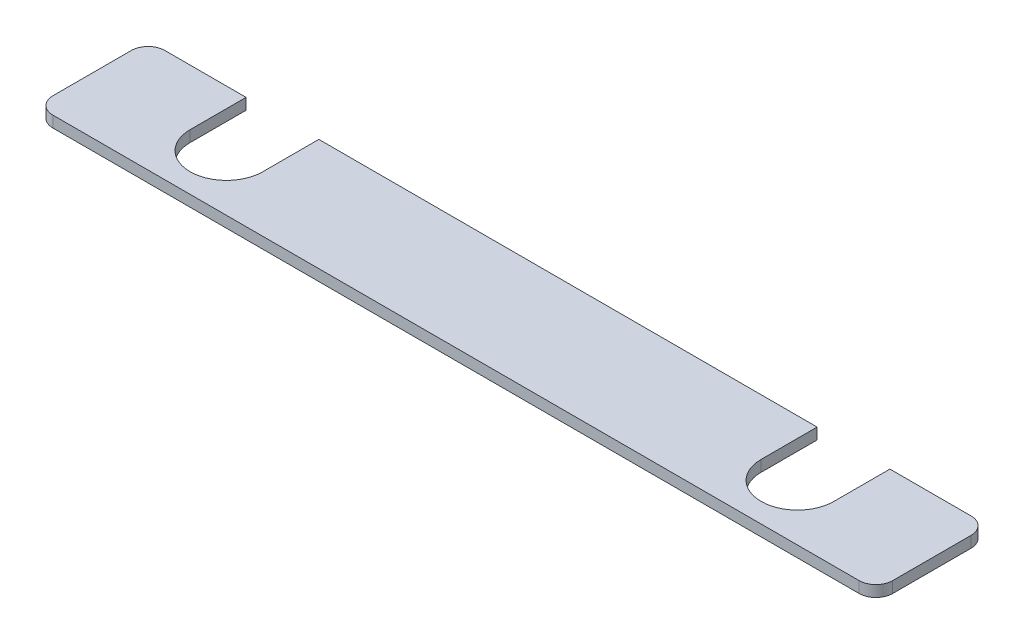
ISO-10303-21;
HEADER;
FILE_DESCRIPTION(('STEP AP214'),'2;1');
FILE_NAME('part.step','',(''),(''),'','','');
FILE_SCHEMA(('AUTOMOTIVE_DESIGN { 1 0 10303 214 1 1 1 1 }'));
ENDSEC;
DATA;
#1=APPLICATION_CONTEXT('core data for automotive mechanical design processes');
#2=APPLICATION_PROTOCOL_DEFINITION('international standard','automotive_design',2000,#1);
#3=PRODUCT_CONTEXT('',#1,'mechanical');
#4=PRODUCT('Part','Part','',(#3));
#5=PRODUCT_RELATED_PRODUCT_CATEGORY('part','',(#4));
#6=PRODUCT_DEFINITION_FORMATION('','',#4);
#7=PRODUCT_DEFINITION_CONTEXT('part definition',#1,'design');
#8=PRODUCT_DEFINITION('design','',#6,#7);
#9=PRODUCT_DEFINITION_SHAPE('','',#8);
#10=(LENGTH_UNIT() NAMED_UNIT(*) SI_UNIT(.MILLI.,.METRE.));
#11=(NAMED_UNIT(*) PLANE_ANGLE_UNIT() SI_UNIT($,.RADIAN.));
#12=(NAMED_UNIT(*) SI_UNIT($,.STERADIAN.) SOLID_ANGLE_UNIT());
#13=UNCERTAINTY_MEASURE_WITH_UNIT(LENGTH_MEASURE(1.E-05),#10,'distance_accuracy_value','');
#14=(GEOMETRIC_REPRESENTATION_CONTEXT(3) GLOBAL_UNCERTAINTY_ASSIGNED_CONTEXT((#13)) GLOBAL_UNIT_ASSIGNED_CONTEXT((#10,
#11,#12)) REPRESENTATION_CONTEXT('',''));
#15=CARTESIAN_POINT('',(0.,0.,0.));
#16=DIRECTION('',(0.,0.,1.));
#17=DIRECTION('',(1.,0.,0.));
#18=AXIS2_PLACEMENT_3D('',#15,#16,#17);
#19=CARTESIAN_POINT('',(-75.,-2.,-10.));
#20=DIRECTION('',(0.,0.,-1.));
#21=DIRECTION('',(-1.,0.,0.));
#22=AXIS2_PLACEMENT_3D('',#19,#20,#21);
#23=PLANE('',#22);
#24=DIRECTION('',(-1.,0.,0.));
#25=VECTOR('',#24,1.);
#26=CARTESIAN_POINT('',(-75.,0.,-10.));
#27=LINE('',#26,#25);
#28=CARTESIAN_POINT('',(72.,0.,-10.));
#29=VERTEX_POINT('',#28);
#30=CARTESIAN_POINT('',(57.5,0.,-10.));
#31=VERTEX_POINT('',#30);
#32=EDGE_CURVE('E228',#29,#31,#27,.T.);
#33=ORIENTED_EDGE('',*,*,#32,.F.);
#34=DIRECTION('',(0.,1.,0.));
#35=VECTOR('',#34,1.);
#36=CARTESIAN_POINT('',(72.,-2.,-10.));
#37=LINE('',#36,#35);
#38=CARTESIAN_POINT('',(72.,-2.,-10.));
#39=VERTEX_POINT('',#38);
#40=EDGE_CURVE('E265',#29,#39,#37,.F.);
#41=ORIENTED_EDGE('',*,*,#40,.T.);
#42=DIRECTION('',(-1.,0.,0.));
#43=VECTOR('',#42,1.);
#44=CARTESIAN_POINT('',(-75.,-2.,-10.));
#45=LINE('',#44,#43);
#46=CARTESIAN_POINT('',(57.5,-2.,-10.));
#47=VERTEX_POINT('',#46);
#48=EDGE_CURVE('E217',#39,#47,#45,.T.);
#49=ORIENTED_EDGE('',*,*,#48,.T.);
#50=DIRECTION('',(0.,1.,0.));
#51=VECTOR('',#50,1.);
#52=CARTESIAN_POINT('',(57.5,-2.,-10.));
#53=LINE('',#52,#51);
#54=EDGE_CURVE('E184',#47,#31,#53,.T.);
#55=ORIENTED_EDGE('',*,*,#54,.T.);
#56=EDGE_LOOP('',(#33,#41,#49,#55));
#57=FACE_BOUND('',#56,.T.);
#58=ADVANCED_FACE('F36',(#57),#23,.T.);
#59=CARTESIAN_POINT('',(44.5,0.,-10.));
#60=VERTEX_POINT('',#59);
#61=CARTESIAN_POINT('',(-44.5,0.,-10.));
#62=VERTEX_POINT('',#61);
#63=EDGE_CURVE('E231',#60,#62,#27,.T.);
#64=ORIENTED_EDGE('',*,*,#63,.F.);
#65=DIRECTION('',(0.,-1.,0.));
#66=VECTOR('',#65,1.);
#67=CARTESIAN_POINT('',(44.5,-2.,-10.));
#68=LINE('',#67,#66);
#69=CARTESIAN_POINT('',(44.5,-2.,-10.));
#70=VERTEX_POINT('',#69);
#71=EDGE_CURVE('E181',#60,#70,#68,.T.);
#72=ORIENTED_EDGE('',*,*,#71,.T.);
#73=CARTESIAN_POINT('',(-44.5,-2.,-10.));
#74=VERTEX_POINT('',#73);
#75=EDGE_CURVE('E174',#70,#74,#45,.T.);
#76=ORIENTED_EDGE('',*,*,#75,.T.);
#77=DIRECTION('',(0.,-1.,0.));
#78=VECTOR('',#77,1.);
#79=CARTESIAN_POINT('',(-44.5,-2.,-10.));
#80=LINE('',#79,#78);
#81=EDGE_CURVE('E208',#62,#74,#80,.T.);
#82=ORIENTED_EDGE('',*,*,#81,.F.);
#83=EDGE_LOOP('',(#64,#72,#76,#82));
#84=FACE_BOUND('',#83,.T.);
#85=ADVANCED_FACE('F288',(#84),#23,.T.);
#86=CARTESIAN_POINT('',(0.,-2.,0.));
#87=DIRECTION('',(0.,-1.,0.));
#88=DIRECTION('',(0.,0.,-1.));
#89=AXIS2_PLACEMENT_3D('',#86,#87,#88);
#90=PLANE('',#89);
#91=DIRECTION('',(0.,0.,-1.));
#92=VECTOR('',#91,1.);
#93=CARTESIAN_POINT('',(75.,-2.,10.));
#94=LINE('',#93,#92);
#95=CARTESIAN_POINT('',(75.,-2.,7.));
#96=VERTEX_POINT('',#95);
#97=CARTESIAN_POINT('',(75.,-2.,-7.));
#98=VERTEX_POINT('',#97);
#99=EDGE_CURVE('E212',#96,#98,#94,.T.);
#100=ORIENTED_EDGE('',*,*,#99,.F.);
#101=CARTESIAN_POINT('',(72.,-2.,7.));
#102=DIRECTION('',(0.,-1.,0.));
#103=DIRECTION('',(0.,0.,-1.));
#104=AXIS2_PLACEMENT_3D('',#101,#102,#103);
#105=CIRCLE('',#104,3.);
#106=CARTESIAN_POINT('',(72.,-2.,10.));
#107=VERTEX_POINT('',#106);
#108=EDGE_CURVE('E263',#96,#107,#105,.T.);
#109=ORIENTED_EDGE('',*,*,#108,.T.);
#110=DIRECTION('',(1.,0.,0.));
#111=VECTOR('',#110,1.);
#112=CARTESIAN_POINT('',(-75.,-2.,10.));
#113=LINE('',#112,#111);
#114=CARTESIAN_POINT('',(-72.,-2.,10.));
#115=VERTEX_POINT('',#114);
#116=EDGE_CURVE('E221',#115,#107,#113,.T.);
#117=ORIENTED_EDGE('',*,*,#116,.F.);
#118=CARTESIAN_POINT('',(-72.,-2.,7.));
#119=DIRECTION('',(0.,-1.,0.));
#120=DIRECTION('',(0.,0.,-1.));
#121=AXIS2_PLACEMENT_3D('',#118,#119,#120);
#122=CIRCLE('',#121,3.);
#123=CARTESIAN_POINT('',(-75.,-2.,7.));
#124=VERTEX_POINT('',#123);
#125=EDGE_CURVE('E57',#115,#124,#122,.T.);
#126=ORIENTED_EDGE('',*,*,#125,.T.);
#127=DIRECTION('',(0.,0.,1.));
#128=VECTOR('',#127,1.);
#129=CARTESIAN_POINT('',(-75.,-2.,10.));
#130=LINE('',#129,#128);
#131=CARTESIAN_POINT('',(-75.,-2.,-7.));
#132=VERTEX_POINT('',#131);
#133=EDGE_CURVE('E219',#132,#124,#130,.T.);
#134=ORIENTED_EDGE('',*,*,#133,.F.);
#135=CARTESIAN_POINT('',(-72.,-2.,-7.));
#136=DIRECTION('',(0.,-1.,0.));
#137=DIRECTION('',(0.,0.,-1.));
#138=AXIS2_PLACEMENT_3D('',#135,#136,#137);
#139=CIRCLE('',#138,3.);
#140=CARTESIAN_POINT('',(-72.,-2.,-10.));
#141=VERTEX_POINT('',#140);
#142=EDGE_CURVE('E51',#132,#141,#139,.T.);
#143=ORIENTED_EDGE('',*,*,#142,.T.);
#144=CARTESIAN_POINT('',(-57.5,-2.,-10.));
#145=VERTEX_POINT('',#144);
#146=EDGE_CURVE('E215',#145,#141,#45,.T.);
#147=ORIENTED_EDGE('',*,*,#146,.F.);
#148=DIRECTION('',(0.,0.,1.));
#149=VECTOR('',#148,1.);
#150=CARTESIAN_POINT('',(-57.5,-2.,-20.));
#151=LINE('',#150,#149);
#152=CARTESIAN_POINT('',(-57.5,-2.,0.));
#153=VERTEX_POINT('',#152);
#154=EDGE_CURVE('E188',#145,#153,#151,.T.);
#155=ORIENTED_EDGE('',*,*,#154,.T.);
#156=CARTESIAN_POINT('',(-51.,-2.,0.));
#157=DIRECTION('',(0.,1.,0.));
#158=DIRECTION('',(0.,0.,1.));
#159=AXIS2_PLACEMENT_3D('',#156,#157,#158);
#160=CIRCLE('',#159,6.5);
#161=CARTESIAN_POINT('',(-44.5,-2.,0.));
#162=VERTEX_POINT('',#161);
#163=EDGE_CURVE('E191',#153,#162,#160,.T.);
#164=ORIENTED_EDGE('',*,*,#163,.T.);
#165=DIRECTION('',(0.,0.,-1.));
#166=VECTOR('',#165,1.);
#167=CARTESIAN_POINT('',(-44.5,-2.,-20.));
#168=LINE('',#167,#166);
#169=EDGE_CURVE('E195',#162,#74,#168,.T.);
#170=ORIENTED_EDGE('',*,*,#169,.T.);
#171=ORIENTED_EDGE('',*,*,#75,.F.);
#172=DIRECTION('',(0.,0.,-1.));
#173=VECTOR('',#172,1.);
#174=CARTESIAN_POINT('',(44.5,-2.,-20.));
#175=LINE('',#174,#173);
#176=CARTESIAN_POINT('',(44.5,-2.,0.));
#177=VERTEX_POINT('',#176);
#178=EDGE_CURVE('E161',#177,#70,#175,.T.);
#179=ORIENTED_EDGE('',*,*,#178,.F.);
#180=CARTESIAN_POINT('',(51.,-2.,0.));
#181=DIRECTION('',(0.,-1.,0.));
#182=DIRECTION('',(0.,0.,1.));
#183=AXIS2_PLACEMENT_3D('',#180,#181,#182);
#184=CIRCLE('',#183,6.5);
#185=CARTESIAN_POINT('',(57.5,-2.,0.));
#186=VERTEX_POINT('',#185);
#187=EDGE_CURVE('E151',#186,#177,#184,.T.);
#188=ORIENTED_EDGE('',*,*,#187,.F.);
#189=DIRECTION('',(0.,0.,1.));
#190=VECTOR('',#189,1.);
#191=CARTESIAN_POINT('',(57.5,-2.,-20.));
#192=LINE('',#191,#190);
#193=EDGE_CURVE('E160',#47,#186,#192,.T.);
#194=ORIENTED_EDGE('',*,*,#193,.F.);
#195=ORIENTED_EDGE('',*,*,#48,.F.);
#196=CARTESIAN_POINT('',(72.,-2.,-7.));
#197=DIRECTION('',(0.,-1.,0.));
#198=DIRECTION('',(0.,0.,-1.));
#199=AXIS2_PLACEMENT_3D('',#196,#197,#198);
#200=CIRCLE('',#199,3.);
#201=EDGE_CURVE('E261',#39,#98,#200,.T.);
#202=ORIENTED_EDGE('',*,*,#201,.T.);
#203=EDGE_LOOP('',(#100,#109,#117,#126,#134,#143,#147,#155,#164,#170,#171,#179,#188,#194,#195,#202));
#204=FACE_BOUND('',#203,.T.);
#205=ADVANCED_FACE('F172',(#204),#90,.T.);
#206=CARTESIAN_POINT('',(0.,0.,0.));
#207=DIRECTION('',(0.,-1.,0.));
#208=DIRECTION('',(0.,0.,-1.));
#209=AXIS2_PLACEMENT_3D('',#206,#207,#208);
#210=PLANE('',#209);
#211=DIRECTION('',(1.,0.,0.));
#212=VECTOR('',#211,1.);
#213=CARTESIAN_POINT('',(-75.,0.,10.));
#214=LINE('',#213,#212);
#215=CARTESIAN_POINT('',(-72.,0.,10.));
#216=VERTEX_POINT('',#215);
#217=CARTESIAN_POINT('',(72.,0.,10.));
#218=VERTEX_POINT('',#217);
#219=EDGE_CURVE('E216',#216,#218,#214,.T.);
#220=ORIENTED_EDGE('',*,*,#219,.T.);
#221=CARTESIAN_POINT('',(72.,0.,7.));
#222=DIRECTION('',(0.,-1.,0.));
#223=DIRECTION('',(0.,0.,-1.));
#224=AXIS2_PLACEMENT_3D('',#221,#222,#223);
#225=CIRCLE('',#224,3.);
#226=CARTESIAN_POINT('',(75.,0.,7.));
#227=VERTEX_POINT('',#226);
#228=EDGE_CURVE('E252',#218,#227,#225,.F.);
#229=ORIENTED_EDGE('',*,*,#228,.T.);
#230=DIRECTION('',(0.,0.,-1.));
#231=VECTOR('',#230,1.);
#232=CARTESIAN_POINT('',(75.,0.,10.));
#233=LINE('',#232,#231);
#234=CARTESIAN_POINT('',(75.,0.,-7.));
#235=VERTEX_POINT('',#234);
#236=EDGE_CURVE('E211',#227,#235,#233,.T.);
#237=ORIENTED_EDGE('',*,*,#236,.T.);
#238=CARTESIAN_POINT('',(72.,0.,-7.));
#239=DIRECTION('',(0.,-1.,0.));
#240=DIRECTION('',(0.,0.,-1.));
#241=AXIS2_PLACEMENT_3D('',#238,#239,#240);
#242=CIRCLE('',#241,3.);
#243=EDGE_CURVE('E250',#235,#29,#242,.F.);
#244=ORIENTED_EDGE('',*,*,#243,.T.);
#245=ORIENTED_EDGE('',*,*,#32,.T.);
#246=DIRECTION('',(0.,0.,-1.));
#247=VECTOR('',#246,1.);
#248=CARTESIAN_POINT('',(57.5,0.,0.));
#249=LINE('',#248,#247);
#250=CARTESIAN_POINT('',(57.5,0.,0.));
#251=VERTEX_POINT('',#250);
#252=EDGE_CURVE('E238',#251,#31,#249,.T.);
#253=ORIENTED_EDGE('',*,*,#252,.F.);
#254=CARTESIAN_POINT('',(51.,0.,0.));
#255=DIRECTION('',(0.,-1.,0.));
#256=DIRECTION('',(0.,0.,1.));
#257=AXIS2_PLACEMENT_3D('',#254,#255,#256);
#258=CIRCLE('',#257,6.5);
#259=CARTESIAN_POINT('',(44.5,0.,0.));
#260=VERTEX_POINT('',#259);
#261=EDGE_CURVE('E175',#251,#260,#258,.T.);
#262=ORIENTED_EDGE('',*,*,#261,.T.);
#263=DIRECTION('',(0.,0.,-1.));
#264=VECTOR('',#263,1.);
#265=CARTESIAN_POINT('',(44.5,0.,-20.));
#266=LINE('',#265,#264);
#267=EDGE_CURVE('E167',#260,#60,#266,.T.);
#268=ORIENTED_EDGE('',*,*,#267,.T.);
#269=ORIENTED_EDGE('',*,*,#63,.T.);
#270=DIRECTION('',(0.,0.,-1.));
#271=VECTOR('',#270,1.);
#272=CARTESIAN_POINT('',(-44.5,0.,-20.));
#273=LINE('',#272,#271);
#274=CARTESIAN_POINT('',(-44.5,0.,0.));
#275=VERTEX_POINT('',#274);
#276=EDGE_CURVE('E192',#275,#62,#273,.T.);
#277=ORIENTED_EDGE('',*,*,#276,.F.);
#278=CARTESIAN_POINT('',(-51.,0.,0.));
#279=DIRECTION('',(0.,1.,0.));
#280=DIRECTION('',(0.,0.,1.));
#281=AXIS2_PLACEMENT_3D('',#278,#279,#280);
#282=CIRCLE('',#281,6.5);
#283=CARTESIAN_POINT('',(-57.5,0.,0.));
#284=VERTEX_POINT('',#283);
#285=EDGE_CURVE('E187',#284,#275,#282,.T.);
#286=ORIENTED_EDGE('',*,*,#285,.F.);
#287=DIRECTION('',(0.,0.,-1.));
#288=VECTOR('',#287,1.);
#289=CARTESIAN_POINT('',(-57.5,0.,0.));
#290=LINE('',#289,#288);
#291=CARTESIAN_POINT('',(-57.5,0.,-10.));
#292=VERTEX_POINT('',#291);
#293=EDGE_CURVE('E224',#284,#292,#290,.T.);
#294=ORIENTED_EDGE('',*,*,#293,.T.);
#295=CARTESIAN_POINT('',(-72.,0.,-10.));
#296=VERTEX_POINT('',#295);
#297=EDGE_CURVE('E227',#292,#296,#27,.T.);
#298=ORIENTED_EDGE('',*,*,#297,.T.);
#299=CARTESIAN_POINT('',(-72.,0.,-7.));
#300=DIRECTION('',(0.,-1.,0.));
#301=DIRECTION('',(0.,0.,-1.));
#302=AXIS2_PLACEMENT_3D('',#299,#300,#301);
#303=CIRCLE('',#302,3.);
#304=CARTESIAN_POINT('',(-75.,0.,-7.));
#305=VERTEX_POINT('',#304);
#306=EDGE_CURVE('E246',#296,#305,#303,.F.);
#307=ORIENTED_EDGE('',*,*,#306,.T.);
#308=DIRECTION('',(0.,0.,1.));
#309=VECTOR('',#308,1.);
#310=CARTESIAN_POINT('',(-75.,0.,10.));
#311=LINE('',#310,#309);
#312=CARTESIAN_POINT('',(-75.,0.,7.));
#313=VERTEX_POINT('',#312);
#314=EDGE_CURVE('E230',#305,#313,#311,.T.);
#315=ORIENTED_EDGE('',*,*,#314,.T.);
#316=CARTESIAN_POINT('',(-72.,0.,7.));
#317=DIRECTION('',(0.,-1.,0.));
#318=DIRECTION('',(0.,0.,-1.));
#319=AXIS2_PLACEMENT_3D('',#316,#317,#318);
#320=CIRCLE('',#319,3.);
#321=EDGE_CURVE('E248',#313,#216,#320,.F.);
#322=ORIENTED_EDGE('',*,*,#321,.T.);
#323=EDGE_LOOP('',(#220,#229,#237,#244,#245,#253,#262,#268,#269,#277,#286,#294,#298,#307,#315,#322));
#324=FACE_BOUND('',#323,.T.);
#325=ADVANCED_FACE('F276',(#324),#210,.F.);
#326=CARTESIAN_POINT('',(75.,-2.,10.));
#327=DIRECTION('',(1.,0.,0.));
#328=DIRECTION('',(0.,0.,-1.));
#329=AXIS2_PLACEMENT_3D('',#326,#327,#328);
#330=PLANE('',#329);
#331=ORIENTED_EDGE('',*,*,#236,.F.);
#332=DIRECTION('',(0.,1.,0.));
#333=VECTOR('',#332,1.);
#334=CARTESIAN_POINT('',(75.,-2.,7.));
#335=LINE('',#334,#333);
#336=EDGE_CURVE('E257',#227,#96,#335,.F.);
#337=ORIENTED_EDGE('',*,*,#336,.T.);
#338=ORIENTED_EDGE('',*,*,#99,.T.);
#339=DIRECTION('',(0.,1.,0.));
#340=VECTOR('',#339,1.);
#341=CARTESIAN_POINT('',(75.,-2.,-7.));
#342=LINE('',#341,#340);
#343=EDGE_CURVE('E254',#98,#235,#342,.T.);
#344=ORIENTED_EDGE('',*,*,#343,.T.);
#345=EDGE_LOOP('',(#331,#337,#338,#344));
#346=FACE_BOUND('',#345,.T.);
#347=ADVANCED_FACE('F311',(#346),#330,.T.);
#348=CARTESIAN_POINT('',(-75.,-2.,10.));
#349=DIRECTION('',(0.,0.,1.));
#350=DIRECTION('',(1.,0.,0.));
#351=AXIS2_PLACEMENT_3D('',#348,#349,#350);
#352=PLANE('',#351);
#353=ORIENTED_EDGE('',*,*,#116,.T.);
#354=DIRECTION('',(0.,1.,0.));
#355=VECTOR('',#354,1.);
#356=CARTESIAN_POINT('',(72.,-2.,10.));
#357=LINE('',#356,#355);
#358=EDGE_CURVE('E243',#107,#218,#357,.T.);
#359=ORIENTED_EDGE('',*,*,#358,.T.);
#360=ORIENTED_EDGE('',*,*,#219,.F.);
#361=DIRECTION('',(0.,1.,0.));
#362=VECTOR('',#361,1.);
#363=CARTESIAN_POINT('',(-72.,-2.,10.));
#364=LINE('',#363,#362);
#365=EDGE_CURVE('E241',#216,#115,#364,.F.);
#366=ORIENTED_EDGE('',*,*,#365,.T.);
#367=EDGE_LOOP('',(#353,#359,#360,#366));
#368=FACE_BOUND('',#367,.T.);
#369=ADVANCED_FACE('F318',(#368),#352,.T.);
#370=CARTESIAN_POINT('',(-75.,-2.,10.));
#371=DIRECTION('',(-1.,0.,0.));
#372=DIRECTION('',(0.,0.,1.));
#373=AXIS2_PLACEMENT_3D('',#370,#371,#372);
#374=PLANE('',#373);
#375=ORIENTED_EDGE('',*,*,#133,.T.);
#376=DIRECTION('',(0.,1.,0.));
#377=VECTOR('',#376,1.);
#378=CARTESIAN_POINT('',(-75.,-2.,7.));
#379=LINE('',#378,#377);
#380=EDGE_CURVE('E44',#124,#313,#379,.T.);
#381=ORIENTED_EDGE('',*,*,#380,.T.);
#382=ORIENTED_EDGE('',*,*,#314,.F.);
#383=DIRECTION('',(0.,1.,0.));
#384=VECTOR('',#383,1.);
#385=CARTESIAN_POINT('',(-75.,-2.,-7.));
#386=LINE('',#385,#384);
#387=EDGE_CURVE('E267',#305,#132,#386,.F.);
#388=ORIENTED_EDGE('',*,*,#387,.T.);
#389=EDGE_LOOP('',(#375,#381,#382,#388));
#390=FACE_BOUND('',#389,.T.);
#391=ADVANCED_FACE('F272',(#390),#374,.T.);
#392=ORIENTED_EDGE('',*,*,#146,.T.);
#393=DIRECTION('',(0.,1.,0.));
#394=VECTOR('',#393,1.);
#395=CARTESIAN_POINT('',(-72.,-2.,-10.));
#396=LINE('',#395,#394);
#397=EDGE_CURVE('E11',#141,#296,#396,.T.);
#398=ORIENTED_EDGE('',*,*,#397,.T.);
#399=ORIENTED_EDGE('',*,*,#297,.F.);
#400=DIRECTION('',(0.,1.,0.));
#401=VECTOR('',#400,1.);
#402=CARTESIAN_POINT('',(-57.5,-2.,-10.));
#403=LINE('',#402,#401);
#404=EDGE_CURVE('E204',#145,#292,#403,.T.);
#405=ORIENTED_EDGE('',*,*,#404,.F.);
#406=EDGE_LOOP('',(#392,#398,#399,#405));
#407=FACE_BOUND('',#406,.T.);
#408=ADVANCED_FACE('F283',(#407),#23,.T.);
#409=CARTESIAN_POINT('',(-44.5,-2.,-20.));
#410=DIRECTION('',(1.,0.,0.));
#411=DIRECTION('',(0.,0.,-1.));
#412=AXIS2_PLACEMENT_3D('',#409,#410,#411);
#413=PLANE('',#412);
#414=ORIENTED_EDGE('',*,*,#81,.T.);
#415=ORIENTED_EDGE('',*,*,#169,.F.);
#416=DIRECTION('',(0.,1.,0.));
#417=VECTOR('',#416,1.);
#418=CARTESIAN_POINT('',(-44.5,-2.,0.));
#419=LINE('',#418,#417);
#420=EDGE_CURVE('E202',#162,#275,#419,.T.);
#421=ORIENTED_EDGE('',*,*,#420,.T.);
#422=ORIENTED_EDGE('',*,*,#276,.T.);
#423=EDGE_LOOP('',(#414,#415,#421,#422));
#424=FACE_BOUND('',#423,.T.);
#425=ADVANCED_FACE('F291',(#424),#413,.F.);
#426=CARTESIAN_POINT('',(-51.,-2.,0.));
#427=DIRECTION('',(0.,1.,0.));
#428=DIRECTION('',(0.,0.,1.));
#429=AXIS2_PLACEMENT_3D('',#426,#427,#428);
#430=CYLINDRICAL_SURFACE('',#429,6.5);
#431=ORIENTED_EDGE('',*,*,#285,.T.);
#432=ORIENTED_EDGE('',*,*,#420,.F.);
#433=ORIENTED_EDGE('',*,*,#163,.F.);
#434=DIRECTION('',(0.,1.,0.));
#435=VECTOR('',#434,1.);
#436=CARTESIAN_POINT('',(-57.5,-2.,0.));
#437=LINE('',#436,#435);
#438=EDGE_CURVE('E197',#153,#284,#437,.T.);
#439=ORIENTED_EDGE('',*,*,#438,.T.);
#440=EDGE_LOOP('',(#431,#432,#433,#439));
#441=FACE_BOUND('',#440,.T.);
#442=ADVANCED_FACE('F295',(#441),#430,.F.);
#443=CARTESIAN_POINT('',(-57.5,-2.,-20.));
#444=DIRECTION('',(-1.,0.,0.));
#445=DIRECTION('',(0.,0.,1.));
#446=AXIS2_PLACEMENT_3D('',#443,#444,#445);
#447=PLANE('',#446);
#448=ORIENTED_EDGE('',*,*,#404,.T.);
#449=ORIENTED_EDGE('',*,*,#293,.F.);
#450=ORIENTED_EDGE('',*,*,#438,.F.);
#451=ORIENTED_EDGE('',*,*,#154,.F.);
#452=EDGE_LOOP('',(#448,#449,#450,#451));
#453=FACE_BOUND('',#452,.T.);
#454=ADVANCED_FACE('F349',(#453),#447,.F.);
#455=CARTESIAN_POINT('',(57.5,-2.,-20.));
#456=DIRECTION('',(-1.,0.,0.));
#457=DIRECTION('',(0.,0.,1.));
#458=AXIS2_PLACEMENT_3D('',#455,#456,#457);
#459=PLANE('',#458);
#460=ORIENTED_EDGE('',*,*,#193,.T.);
#461=DIRECTION('',(0.,1.,0.));
#462=VECTOR('',#461,1.);
#463=CARTESIAN_POINT('',(57.5,-2.,0.));
#464=LINE('',#463,#462);
#465=EDGE_CURVE('E157',#186,#251,#464,.T.);
#466=ORIENTED_EDGE('',*,*,#465,.T.);
#467=ORIENTED_EDGE('',*,*,#252,.T.);
#468=ORIENTED_EDGE('',*,*,#54,.F.);
#469=EDGE_LOOP('',(#460,#466,#467,#468));
#470=FACE_BOUND('',#469,.T.);
#471=ADVANCED_FACE('F301',(#470),#459,.T.);
#472=CARTESIAN_POINT('',(51.,-2.,0.));
#473=DIRECTION('',(0.,1.,0.));
#474=DIRECTION('',(0.,0.,1.));
#475=AXIS2_PLACEMENT_3D('',#472,#473,#474);
#476=CYLINDRICAL_SURFACE('',#475,6.5);
#477=ORIENTED_EDGE('',*,*,#261,.F.);
#478=ORIENTED_EDGE('',*,*,#465,.F.);
#479=ORIENTED_EDGE('',*,*,#187,.T.);
#480=DIRECTION('',(0.,1.,0.));
#481=VECTOR('',#480,1.);
#482=CARTESIAN_POINT('',(44.5,-2.,0.));
#483=LINE('',#482,#481);
#484=EDGE_CURVE('E155',#177,#260,#483,.T.);
#485=ORIENTED_EDGE('',*,*,#484,.T.);
#486=EDGE_LOOP('',(#477,#478,#479,#485));
#487=FACE_BOUND('',#486,.T.);
#488=ADVANCED_FACE('F154',(#487),#476,.F.);
#489=CARTESIAN_POINT('',(44.5,-2.,-20.));
#490=DIRECTION('',(1.,0.,0.));
#491=DIRECTION('',(0.,0.,-1.));
#492=AXIS2_PLACEMENT_3D('',#489,#490,#491);
#493=PLANE('',#492);
#494=ORIENTED_EDGE('',*,*,#267,.F.);
#495=ORIENTED_EDGE('',*,*,#484,.F.);
#496=ORIENTED_EDGE('',*,*,#178,.T.);
#497=ORIENTED_EDGE('',*,*,#71,.F.);
#498=EDGE_LOOP('',(#494,#495,#496,#497));
#499=FACE_BOUND('',#498,.T.);
#500=ADVANCED_FACE('F164',(#499),#493,.T.);
#501=CARTESIAN_POINT('',(72.,-2.,7.));
#502=DIRECTION('',(0.,1.,0.));
#503=DIRECTION('',(0.,0.,1.));
#504=AXIS2_PLACEMENT_3D('',#501,#502,#503);
#505=CYLINDRICAL_SURFACE('',#504,3.);
#506=ORIENTED_EDGE('',*,*,#108,.F.);
#507=ORIENTED_EDGE('',*,*,#336,.F.);
#508=ORIENTED_EDGE('',*,*,#228,.F.);
#509=ORIENTED_EDGE('',*,*,#358,.F.);
#510=EDGE_LOOP('',(#506,#507,#508,#509));
#511=FACE_BOUND('',#510,.T.);
#512=ADVANCED_FACE('F316',(#511),#505,.T.);
#513=CARTESIAN_POINT('',(72.,-2.,-7.));
#514=DIRECTION('',(0.,1.,0.));
#515=DIRECTION('',(0.,0.,1.));
#516=AXIS2_PLACEMENT_3D('',#513,#514,#515);
#517=CYLINDRICAL_SURFACE('',#516,3.);
#518=ORIENTED_EDGE('',*,*,#201,.F.);
#519=ORIENTED_EDGE('',*,*,#40,.F.);
#520=ORIENTED_EDGE('',*,*,#243,.F.);
#521=ORIENTED_EDGE('',*,*,#343,.F.);
#522=EDGE_LOOP('',(#518,#519,#520,#521));
#523=FACE_BOUND('',#522,.T.);
#524=ADVANCED_FACE('F308',(#523),#517,.T.);
#525=CARTESIAN_POINT('',(-72.,-2.,7.));
#526=DIRECTION('',(0.,1.,0.));
#527=DIRECTION('',(0.,0.,1.));
#528=AXIS2_PLACEMENT_3D('',#525,#526,#527);
#529=CYLINDRICAL_SURFACE('',#528,3.);
#530=ORIENTED_EDGE('',*,*,#125,.F.);
#531=ORIENTED_EDGE('',*,*,#365,.F.);
#532=ORIENTED_EDGE('',*,*,#321,.F.);
#533=ORIENTED_EDGE('',*,*,#380,.F.);
#534=EDGE_LOOP('',(#530,#531,#532,#533));
#535=FACE_BOUND('',#534,.T.);
#536=ADVANCED_FACE('F320',(#535),#529,.T.);
#537=CARTESIAN_POINT('',(-72.,-2.,-7.));
#538=DIRECTION('',(0.,1.,0.));
#539=DIRECTION('',(0.,0.,1.));
#540=AXIS2_PLACEMENT_3D('',#537,#538,#539);
#541=CYLINDRICAL_SURFACE('',#540,3.);
#542=ORIENTED_EDGE('',*,*,#142,.F.);
#543=ORIENTED_EDGE('',*,*,#387,.F.);
#544=ORIENTED_EDGE('',*,*,#306,.F.);
#545=ORIENTED_EDGE('',*,*,#397,.F.);
#546=EDGE_LOOP('',(#542,#543,#544,#545));
#547=FACE_BOUND('',#546,.T.);
#548=ADVANCED_FACE('F38',(#547),#541,.T.);
#549=CLOSED_SHELL('',(#58,#85,#205,#325,#347,#369,#391,#408,#425,#442,#454,#471,#488,#500,#512,
#524,#536,#548));
#550=MANIFOLD_SOLID_BREP('B2',#549);
#551=ADVANCED_BREP_SHAPE_REPRESENTATION('',(#18,#550),#14);
#552=SHAPE_DEFINITION_REPRESENTATION(#9,#551);
ENDSEC;
END-ISO-10303-21;
